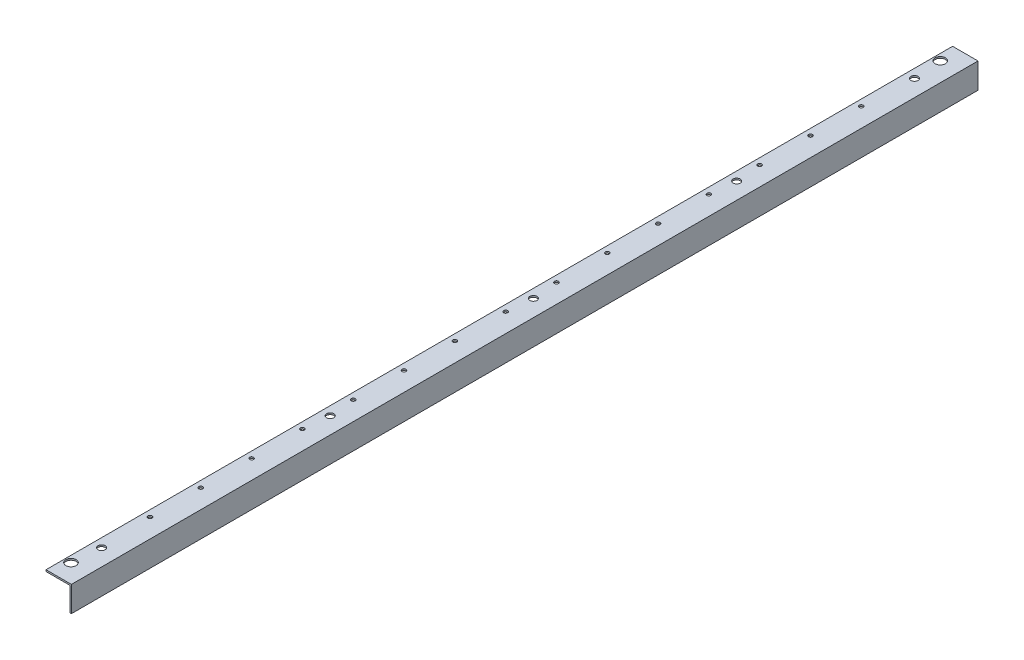
ISO-10303-21;
HEADER;
FILE_DESCRIPTION(('STEP AP214'),'2;1');
FILE_NAME('part.step','',(''),(''),'','','');
FILE_SCHEMA(('AUTOMOTIVE_DESIGN { 1 0 10303 214 1 1 1 1 }'));
ENDSEC;
DATA;
#1=APPLICATION_CONTEXT('core data for automotive mechanical design processes');
#2=APPLICATION_PROTOCOL_DEFINITION('international standard','automotive_design',2000,#1);
#3=PRODUCT_CONTEXT('',#1,'mechanical');
#4=PRODUCT('Part','Part','',(#3));
#5=PRODUCT_RELATED_PRODUCT_CATEGORY('part','',(#4));
#6=PRODUCT_DEFINITION_FORMATION('','',#4);
#7=PRODUCT_DEFINITION_CONTEXT('part definition',#1,'design');
#8=PRODUCT_DEFINITION('design','',#6,#7);
#9=PRODUCT_DEFINITION_SHAPE('','',#8);
#10=(LENGTH_UNIT() NAMED_UNIT(*) SI_UNIT(.MILLI.,.METRE.));
#11=(NAMED_UNIT(*) PLANE_ANGLE_UNIT() SI_UNIT($,.RADIAN.));
#12=(NAMED_UNIT(*) SI_UNIT($,.STERADIAN.) SOLID_ANGLE_UNIT());
#13=UNCERTAINTY_MEASURE_WITH_UNIT(LENGTH_MEASURE(1.E-05),#10,'distance_accuracy_value','');
#14=(GEOMETRIC_REPRESENTATION_CONTEXT(3) GLOBAL_UNCERTAINTY_ASSIGNED_CONTEXT((#13)) GLOBAL_UNIT_ASSIGNED_CONTEXT((#10,
#11,#12)) REPRESENTATION_CONTEXT('',''));
#15=CARTESIAN_POINT('',(0.,0.,0.));
#16=DIRECTION('',(0.,0.,1.));
#17=DIRECTION('',(1.,0.,0.));
#18=AXIS2_PLACEMENT_3D('',#15,#16,#17);
#19=CARTESIAN_POINT('',(-38.1,-44.45,1617.6625));
#20=DIRECTION('',(0.,1.,0.));
#21=DIRECTION('',(0.,0.,1.));
#22=AXIS2_PLACEMENT_3D('',#19,#20,#21);
#23=CYLINDRICAL_SURFACE('',#22,3.96874999999999);
#24=CARTESIAN_POINT('',(-38.1,0.,1617.6625));
#25=DIRECTION('',(0.,1.,0.));
#26=DIRECTION('',(0.,0.,1.));
#27=AXIS2_PLACEMENT_3D('',#24,#25,#26);
#28=CIRCLE('',#27,3.96874999999999);
#29=CARTESIAN_POINT('',(-38.1,0.,1621.63125));
#30=VERTEX_POINT('',#29);
#31=EDGE_CURVE('E47',#30,#30,#28,.T.);
#32=ORIENTED_EDGE('',*,*,#31,.T.);
#33=EDGE_LOOP('',(#32));
#34=FACE_BOUND('',#33,.T.);
#35=CARTESIAN_POINT('',(-38.1,-3.175,1617.6625));
#36=DIRECTION('',(0.,1.,0.));
#37=DIRECTION('',(0.,0.,1.));
#38=AXIS2_PLACEMENT_3D('',#35,#36,#37);
#39=CIRCLE('',#38,3.96874999999999);
#40=CARTESIAN_POINT('',(-38.1,-3.175,1621.63125));
#41=VERTEX_POINT('',#40);
#42=EDGE_CURVE('E11',#41,#41,#39,.T.);
#43=ORIENTED_EDGE('',*,*,#42,.F.);
#44=EDGE_LOOP('',(#43));
#45=FACE_BOUND('',#44,.T.);
#46=ADVANCED_FACE('F39',(#34,#45),#23,.F.);
#47=CARTESIAN_POINT('',(-38.1,-44.45,1516.0625));
#48=DIRECTION('',(0.,1.,0.));
#49=DIRECTION('',(0.,0.,1.));
#50=AXIS2_PLACEMENT_3D('',#47,#48,#49);
#51=CYLINDRICAL_SURFACE('',#50,3.96874999999999);
#52=CARTESIAN_POINT('',(-38.1,0.,1516.0625));
#53=DIRECTION('',(0.,1.,0.));
#54=DIRECTION('',(0.,0.,1.));
#55=AXIS2_PLACEMENT_3D('',#52,#53,#54);
#56=CIRCLE('',#55,3.96874999999999);
#57=CARTESIAN_POINT('',(-38.1,0.,1520.03125));
#58=VERTEX_POINT('',#57);
#59=EDGE_CURVE('E237',#58,#58,#56,.T.);
#60=ORIENTED_EDGE('',*,*,#59,.T.);
#61=EDGE_LOOP('',(#60));
#62=FACE_BOUND('',#61,.T.);
#63=CARTESIAN_POINT('',(-38.1,-3.175,1516.0625));
#64=DIRECTION('',(0.,1.,0.));
#65=DIRECTION('',(0.,0.,1.));
#66=AXIS2_PLACEMENT_3D('',#63,#64,#65);
#67=CIRCLE('',#66,3.96874999999999);
#68=CARTESIAN_POINT('',(-38.1,-3.175,1520.03125));
#69=VERTEX_POINT('',#68);
#70=EDGE_CURVE('E240',#69,#69,#67,.T.);
#71=ORIENTED_EDGE('',*,*,#70,.F.);
#72=EDGE_LOOP('',(#71));
#73=FACE_BOUND('',#72,.T.);
#74=ADVANCED_FACE('F267',(#62,#73),#51,.F.);
#75=CARTESIAN_POINT('',(-38.1,-44.45,1414.4625));
#76=DIRECTION('',(0.,1.,0.));
#77=DIRECTION('',(0.,0.,1.));
#78=AXIS2_PLACEMENT_3D('',#75,#76,#77);
#79=CYLINDRICAL_SURFACE('',#78,3.96874999999999);
#80=CARTESIAN_POINT('',(-38.1,0.,1414.4625));
#81=DIRECTION('',(0.,1.,0.));
#82=DIRECTION('',(0.,0.,1.));
#83=AXIS2_PLACEMENT_3D('',#80,#81,#82);
#84=CIRCLE('',#83,3.96874999999999);
#85=CARTESIAN_POINT('',(-38.1,0.,1418.43125));
#86=VERTEX_POINT('',#85);
#87=EDGE_CURVE('E231',#86,#86,#84,.T.);
#88=ORIENTED_EDGE('',*,*,#87,.T.);
#89=EDGE_LOOP('',(#88));
#90=FACE_BOUND('',#89,.T.);
#91=CARTESIAN_POINT('',(-38.1,-3.175,1414.4625));
#92=DIRECTION('',(0.,1.,0.));
#93=DIRECTION('',(0.,0.,1.));
#94=AXIS2_PLACEMENT_3D('',#91,#92,#93);
#95=CIRCLE('',#94,3.96874999999999);
#96=CARTESIAN_POINT('',(-38.1,-3.175,1418.43125));
#97=VERTEX_POINT('',#96);
#98=EDGE_CURVE('E234',#97,#97,#95,.T.);
#99=ORIENTED_EDGE('',*,*,#98,.F.);
#100=EDGE_LOOP('',(#99));
#101=FACE_BOUND('',#100,.T.);
#102=ADVANCED_FACE('F272',(#90,#101),#79,.F.);
#103=CARTESIAN_POINT('',(-38.1,-44.45,1312.8625));
#104=DIRECTION('',(0.,1.,0.));
#105=DIRECTION('',(0.,0.,1.));
#106=AXIS2_PLACEMENT_3D('',#103,#104,#105);
#107=CYLINDRICAL_SURFACE('',#106,3.96874999999999);
#108=CARTESIAN_POINT('',(-38.1,0.,1312.8625));
#109=DIRECTION('',(0.,1.,0.));
#110=DIRECTION('',(0.,0.,1.));
#111=AXIS2_PLACEMENT_3D('',#108,#109,#110);
#112=CIRCLE('',#111,3.96874999999999);
#113=CARTESIAN_POINT('',(-38.1,0.,1316.83125));
#114=VERTEX_POINT('',#113);
#115=EDGE_CURVE('E225',#114,#114,#112,.T.);
#116=ORIENTED_EDGE('',*,*,#115,.T.);
#117=EDGE_LOOP('',(#116));
#118=FACE_BOUND('',#117,.T.);
#119=CARTESIAN_POINT('',(-38.1,-3.175,1312.8625));
#120=DIRECTION('',(0.,1.,0.));
#121=DIRECTION('',(0.,0.,1.));
#122=AXIS2_PLACEMENT_3D('',#119,#120,#121);
#123=CIRCLE('',#122,3.96874999999999);
#124=CARTESIAN_POINT('',(-38.1,-3.175,1316.83125));
#125=VERTEX_POINT('',#124);
#126=EDGE_CURVE('E228',#125,#125,#123,.T.);
#127=ORIENTED_EDGE('',*,*,#126,.F.);
#128=EDGE_LOOP('',(#127));
#129=FACE_BOUND('',#128,.T.);
#130=ADVANCED_FACE('F277',(#118,#129),#107,.F.);
#131=CARTESIAN_POINT('',(-38.1,-44.45,1211.2625));
#132=DIRECTION('',(0.,1.,0.));
#133=DIRECTION('',(0.,0.,1.));
#134=AXIS2_PLACEMENT_3D('',#131,#132,#133);
#135=CYLINDRICAL_SURFACE('',#134,3.96874999999999);
#136=CARTESIAN_POINT('',(-38.1,0.,1211.2625));
#137=DIRECTION('',(0.,1.,0.));
#138=DIRECTION('',(0.,0.,1.));
#139=AXIS2_PLACEMENT_3D('',#136,#137,#138);
#140=CIRCLE('',#139,3.96874999999999);
#141=CARTESIAN_POINT('',(-38.1,0.,1215.23125));
#142=VERTEX_POINT('',#141);
#143=EDGE_CURVE('E219',#142,#142,#140,.T.);
#144=ORIENTED_EDGE('',*,*,#143,.T.);
#145=EDGE_LOOP('',(#144));
#146=FACE_BOUND('',#145,.T.);
#147=CARTESIAN_POINT('',(-38.1,-3.175,1211.2625));
#148=DIRECTION('',(0.,1.,0.));
#149=DIRECTION('',(0.,0.,1.));
#150=AXIS2_PLACEMENT_3D('',#147,#148,#149);
#151=CIRCLE('',#150,3.96874999999999);
#152=CARTESIAN_POINT('',(-38.1,-3.175,1215.23125));
#153=VERTEX_POINT('',#152);
#154=EDGE_CURVE('E222',#153,#153,#151,.T.);
#155=ORIENTED_EDGE('',*,*,#154,.F.);
#156=EDGE_LOOP('',(#155));
#157=FACE_BOUND('',#156,.T.);
#158=ADVANCED_FACE('F284',(#146,#157),#135,.F.);
#159=CARTESIAN_POINT('',(-38.1,-44.45,1109.6625));
#160=DIRECTION('',(0.,1.,0.));
#161=DIRECTION('',(0.,0.,1.));
#162=AXIS2_PLACEMENT_3D('',#159,#160,#161);
#163=CYLINDRICAL_SURFACE('',#162,3.96874999999999);
#164=CARTESIAN_POINT('',(-38.1,0.,1109.6625));
#165=DIRECTION('',(0.,1.,0.));
#166=DIRECTION('',(0.,0.,1.));
#167=AXIS2_PLACEMENT_3D('',#164,#165,#166);
#168=CIRCLE('',#167,3.96874999999999);
#169=CARTESIAN_POINT('',(-38.1,0.,1113.63125));
#170=VERTEX_POINT('',#169);
#171=EDGE_CURVE('E213',#170,#170,#168,.T.);
#172=ORIENTED_EDGE('',*,*,#171,.T.);
#173=EDGE_LOOP('',(#172));
#174=FACE_BOUND('',#173,.T.);
#175=CARTESIAN_POINT('',(-38.1,-3.175,1109.6625));
#176=DIRECTION('',(0.,1.,0.));
#177=DIRECTION('',(0.,0.,1.));
#178=AXIS2_PLACEMENT_3D('',#175,#176,#177);
#179=CIRCLE('',#178,3.96874999999999);
#180=CARTESIAN_POINT('',(-38.1,-3.175,1113.63125));
#181=VERTEX_POINT('',#180);
#182=EDGE_CURVE('E216',#181,#181,#179,.T.);
#183=ORIENTED_EDGE('',*,*,#182,.F.);
#184=EDGE_LOOP('',(#183));
#185=FACE_BOUND('',#184,.T.);
#186=ADVANCED_FACE('F288',(#174,#185),#163,.F.);
#187=CARTESIAN_POINT('',(-38.1,-44.45,1008.0625));
#188=DIRECTION('',(0.,1.,0.));
#189=DIRECTION('',(0.,0.,1.));
#190=AXIS2_PLACEMENT_3D('',#187,#188,#189);
#191=CYLINDRICAL_SURFACE('',#190,3.96874999999999);
#192=CARTESIAN_POINT('',(-38.1,0.,1008.0625));
#193=DIRECTION('',(0.,1.,0.));
#194=DIRECTION('',(0.,0.,1.));
#195=AXIS2_PLACEMENT_3D('',#192,#193,#194);
#196=CIRCLE('',#195,3.96874999999999);
#197=CARTESIAN_POINT('',(-38.1,0.,1012.03125));
#198=VERTEX_POINT('',#197);
#199=EDGE_CURVE('E207',#198,#198,#196,.T.);
#200=ORIENTED_EDGE('',*,*,#199,.T.);
#201=EDGE_LOOP('',(#200));
#202=FACE_BOUND('',#201,.T.);
#203=CARTESIAN_POINT('',(-38.1,-3.175,1008.0625));
#204=DIRECTION('',(0.,1.,0.));
#205=DIRECTION('',(0.,0.,1.));
#206=AXIS2_PLACEMENT_3D('',#203,#204,#205);
#207=CIRCLE('',#206,3.96874999999999);
#208=CARTESIAN_POINT('',(-38.1,-3.175,1012.03125));
#209=VERTEX_POINT('',#208);
#210=EDGE_CURVE('E210',#209,#209,#207,.T.);
#211=ORIENTED_EDGE('',*,*,#210,.F.);
#212=EDGE_LOOP('',(#211));
#213=FACE_BOUND('',#212,.T.);
#214=ADVANCED_FACE('F292',(#202,#213),#191,.F.);
#215=CARTESIAN_POINT('',(-38.1,-44.45,906.4625));
#216=DIRECTION('',(0.,1.,0.));
#217=DIRECTION('',(0.,0.,1.));
#218=AXIS2_PLACEMENT_3D('',#215,#216,#217);
#219=CYLINDRICAL_SURFACE('',#218,3.96874999999999);
#220=CARTESIAN_POINT('',(-38.1,0.,906.4625));
#221=DIRECTION('',(0.,1.,0.));
#222=DIRECTION('',(0.,0.,1.));
#223=AXIS2_PLACEMENT_3D('',#220,#221,#222);
#224=CIRCLE('',#223,3.96874999999999);
#225=CARTESIAN_POINT('',(-38.1,0.,910.43125));
#226=VERTEX_POINT('',#225);
#227=EDGE_CURVE('E201',#226,#226,#224,.T.);
#228=ORIENTED_EDGE('',*,*,#227,.T.);
#229=EDGE_LOOP('',(#228));
#230=FACE_BOUND('',#229,.T.);
#231=CARTESIAN_POINT('',(-38.1,-3.175,906.4625));
#232=DIRECTION('',(0.,1.,0.));
#233=DIRECTION('',(0.,0.,1.));
#234=AXIS2_PLACEMENT_3D('',#231,#232,#233);
#235=CIRCLE('',#234,3.96874999999999);
#236=CARTESIAN_POINT('',(-38.1,-3.175,910.43125));
#237=VERTEX_POINT('',#236);
#238=EDGE_CURVE('E204',#237,#237,#235,.T.);
#239=ORIENTED_EDGE('',*,*,#238,.F.);
#240=EDGE_LOOP('',(#239));
#241=FACE_BOUND('',#240,.T.);
#242=ADVANCED_FACE('F296',(#230,#241),#219,.F.);
#243=CARTESIAN_POINT('',(-38.1,-44.45,804.8625));
#244=DIRECTION('',(0.,1.,0.));
#245=DIRECTION('',(0.,0.,1.));
#246=AXIS2_PLACEMENT_3D('',#243,#244,#245);
#247=CYLINDRICAL_SURFACE('',#246,3.96874999999999);
#248=CARTESIAN_POINT('',(-38.1,0.,804.8625));
#249=DIRECTION('',(0.,1.,0.));
#250=DIRECTION('',(0.,0.,1.));
#251=AXIS2_PLACEMENT_3D('',#248,#249,#250);
#252=CIRCLE('',#251,3.96874999999999);
#253=CARTESIAN_POINT('',(-38.1,0.,808.83125));
#254=VERTEX_POINT('',#253);
#255=EDGE_CURVE('E195',#254,#254,#252,.T.);
#256=ORIENTED_EDGE('',*,*,#255,.T.);
#257=EDGE_LOOP('',(#256));
#258=FACE_BOUND('',#257,.T.);
#259=CARTESIAN_POINT('',(-38.1,-3.175,804.8625));
#260=DIRECTION('',(0.,1.,0.));
#261=DIRECTION('',(0.,0.,1.));
#262=AXIS2_PLACEMENT_3D('',#259,#260,#261);
#263=CIRCLE('',#262,3.96874999999999);
#264=CARTESIAN_POINT('',(-38.1,-3.175,808.83125));
#265=VERTEX_POINT('',#264);
#266=EDGE_CURVE('E198',#265,#265,#263,.T.);
#267=ORIENTED_EDGE('',*,*,#266,.F.);
#268=EDGE_LOOP('',(#267));
#269=FACE_BOUND('',#268,.T.);
#270=ADVANCED_FACE('F300',(#258,#269),#247,.F.);
#271=CARTESIAN_POINT('',(-38.1,-44.45,703.2625));
#272=DIRECTION('',(0.,1.,0.));
#273=DIRECTION('',(0.,0.,1.));
#274=AXIS2_PLACEMENT_3D('',#271,#272,#273);
#275=CYLINDRICAL_SURFACE('',#274,3.96874999999999);
#276=CARTESIAN_POINT('',(-38.1,0.,703.2625));
#277=DIRECTION('',(0.,1.,0.));
#278=DIRECTION('',(0.,0.,1.));
#279=AXIS2_PLACEMENT_3D('',#276,#277,#278);
#280=CIRCLE('',#279,3.96874999999999);
#281=CARTESIAN_POINT('',(-38.1,0.,707.23125));
#282=VERTEX_POINT('',#281);
#283=EDGE_CURVE('E189',#282,#282,#280,.T.);
#284=ORIENTED_EDGE('',*,*,#283,.T.);
#285=EDGE_LOOP('',(#284));
#286=FACE_BOUND('',#285,.T.);
#287=CARTESIAN_POINT('',(-38.1,-3.175,703.2625));
#288=DIRECTION('',(0.,1.,0.));
#289=DIRECTION('',(0.,0.,1.));
#290=AXIS2_PLACEMENT_3D('',#287,#288,#289);
#291=CIRCLE('',#290,3.96874999999999);
#292=CARTESIAN_POINT('',(-38.1,-3.175,707.23125));
#293=VERTEX_POINT('',#292);
#294=EDGE_CURVE('E192',#293,#293,#291,.T.);
#295=ORIENTED_EDGE('',*,*,#294,.F.);
#296=EDGE_LOOP('',(#295));
#297=FACE_BOUND('',#296,.T.);
#298=ADVANCED_FACE('F304',(#286,#297),#275,.F.);
#299=CARTESIAN_POINT('',(-38.1,-44.45,601.6625));
#300=DIRECTION('',(0.,1.,0.));
#301=DIRECTION('',(0.,0.,1.));
#302=AXIS2_PLACEMENT_3D('',#299,#300,#301);
#303=CYLINDRICAL_SURFACE('',#302,3.96874999999999);
#304=CARTESIAN_POINT('',(-38.1,0.,601.6625));
#305=DIRECTION('',(0.,1.,0.));
#306=DIRECTION('',(0.,0.,1.));
#307=AXIS2_PLACEMENT_3D('',#304,#305,#306);
#308=CIRCLE('',#307,3.96874999999999);
#309=CARTESIAN_POINT('',(-38.1,0.,605.63125));
#310=VERTEX_POINT('',#309);
#311=EDGE_CURVE('E183',#310,#310,#308,.T.);
#312=ORIENTED_EDGE('',*,*,#311,.T.);
#313=EDGE_LOOP('',(#312));
#314=FACE_BOUND('',#313,.T.);
#315=CARTESIAN_POINT('',(-38.1,-3.175,601.6625));
#316=DIRECTION('',(0.,1.,0.));
#317=DIRECTION('',(0.,0.,1.));
#318=AXIS2_PLACEMENT_3D('',#315,#316,#317);
#319=CIRCLE('',#318,3.96874999999999);
#320=CARTESIAN_POINT('',(-38.1,-3.175,605.63125));
#321=VERTEX_POINT('',#320);
#322=EDGE_CURVE('E186',#321,#321,#319,.T.);
#323=ORIENTED_EDGE('',*,*,#322,.F.);
#324=EDGE_LOOP('',(#323));
#325=FACE_BOUND('',#324,.T.);
#326=ADVANCED_FACE('F308',(#314,#325),#303,.F.);
#327=CARTESIAN_POINT('',(-38.1,-44.45,500.0625));
#328=DIRECTION('',(0.,1.,0.));
#329=DIRECTION('',(0.,0.,1.));
#330=AXIS2_PLACEMENT_3D('',#327,#328,#329);
#331=CYLINDRICAL_SURFACE('',#330,3.96874999999999);
#332=CARTESIAN_POINT('',(-38.1,0.,500.0625));
#333=DIRECTION('',(0.,1.,0.));
#334=DIRECTION('',(0.,0.,1.));
#335=AXIS2_PLACEMENT_3D('',#332,#333,#334);
#336=CIRCLE('',#335,3.96874999999999);
#337=CARTESIAN_POINT('',(-38.1,0.,504.03125));
#338=VERTEX_POINT('',#337);
#339=EDGE_CURVE('E177',#338,#338,#336,.T.);
#340=ORIENTED_EDGE('',*,*,#339,.T.);
#341=EDGE_LOOP('',(#340));
#342=FACE_BOUND('',#341,.T.);
#343=CARTESIAN_POINT('',(-38.1,-3.175,500.0625));
#344=DIRECTION('',(0.,1.,0.));
#345=DIRECTION('',(0.,0.,1.));
#346=AXIS2_PLACEMENT_3D('',#343,#344,#345);
#347=CIRCLE('',#346,3.96874999999999);
#348=CARTESIAN_POINT('',(-38.1,-3.175,504.03125));
#349=VERTEX_POINT('',#348);
#350=EDGE_CURVE('E180',#349,#349,#347,.T.);
#351=ORIENTED_EDGE('',*,*,#350,.F.);
#352=EDGE_LOOP('',(#351));
#353=FACE_BOUND('',#352,.T.);
#354=ADVANCED_FACE('F312',(#342,#353),#331,.F.);
#355=CARTESIAN_POINT('',(-38.1,-44.45,398.4625));
#356=DIRECTION('',(0.,1.,0.));
#357=DIRECTION('',(0.,0.,1.));
#358=AXIS2_PLACEMENT_3D('',#355,#356,#357);
#359=CYLINDRICAL_SURFACE('',#358,3.96874999999999);
#360=CARTESIAN_POINT('',(-38.1,0.,398.4625));
#361=DIRECTION('',(0.,1.,0.));
#362=DIRECTION('',(0.,0.,1.));
#363=AXIS2_PLACEMENT_3D('',#360,#361,#362);
#364=CIRCLE('',#363,3.96874999999999);
#365=CARTESIAN_POINT('',(-38.1,0.,402.43125));
#366=VERTEX_POINT('',#365);
#367=EDGE_CURVE('E145',#366,#366,#364,.T.);
#368=ORIENTED_EDGE('',*,*,#367,.T.);
#369=EDGE_LOOP('',(#368));
#370=FACE_BOUND('',#369,.T.);
#371=CARTESIAN_POINT('',(-38.1,-3.175,398.4625));
#372=DIRECTION('',(0.,1.,0.));
#373=DIRECTION('',(0.,0.,1.));
#374=AXIS2_PLACEMENT_3D('',#371,#372,#373);
#375=CIRCLE('',#374,3.96874999999999);
#376=CARTESIAN_POINT('',(-38.1,-3.175,402.43125));
#377=VERTEX_POINT('',#376);
#378=EDGE_CURVE('E174',#377,#377,#375,.T.);
#379=ORIENTED_EDGE('',*,*,#378,.F.);
#380=EDGE_LOOP('',(#379));
#381=FACE_BOUND('',#380,.T.);
#382=ADVANCED_FACE('F261',(#370,#381),#359,.F.);
#383=CARTESIAN_POINT('',(0.,-50.8,1812.925));
#384=DIRECTION('',(-1.,0.,0.));
#385=DIRECTION('',(0.,0.,1.));
#386=AXIS2_PLACEMENT_3D('',#383,#384,#385);
#387=PLANE('',#386);
#388=DIRECTION('',(0.,1.,0.));
#389=VECTOR('',#388,1.);
#390=CARTESIAN_POINT('',(0.,-50.8,0.));
#391=LINE('',#390,#389);
#392=CARTESIAN_POINT('',(0.,-50.8,0.));
#393=VERTEX_POINT('',#392);
#394=CARTESIAN_POINT('',(0.,0.,0.));
#395=VERTEX_POINT('',#394);
#396=EDGE_CURVE('E125',#393,#395,#391,.T.);
#397=ORIENTED_EDGE('',*,*,#396,.T.);
#398=DIRECTION('',(0.,0.,-1.));
#399=VECTOR('',#398,1.);
#400=CARTESIAN_POINT('',(0.,0.,1812.925));
#401=LINE('',#400,#399);
#402=CARTESIAN_POINT('',(0.,0.,1812.925));
#403=VERTEX_POINT('',#402);
#404=EDGE_CURVE('E143',#403,#395,#401,.T.);
#405=ORIENTED_EDGE('',*,*,#404,.F.);
#406=DIRECTION('',(0.,1.,0.));
#407=VECTOR('',#406,1.);
#408=CARTESIAN_POINT('',(0.,-50.8,1812.925));
#409=LINE('',#408,#407);
#410=CARTESIAN_POINT('',(0.,-50.8,1812.925));
#411=VERTEX_POINT('',#410);
#412=EDGE_CURVE('E136',#411,#403,#409,.T.);
#413=ORIENTED_EDGE('',*,*,#412,.F.);
#414=DIRECTION('',(0.,0.,-1.));
#415=VECTOR('',#414,1.);
#416=CARTESIAN_POINT('',(0.,-50.8,1812.925));
#417=LINE('',#416,#415);
#418=EDGE_CURVE('E121',#411,#393,#417,.T.);
#419=ORIENTED_EDGE('',*,*,#418,.T.);
#420=EDGE_LOOP('',(#397,#405,#413,#419));
#421=FACE_BOUND('',#420,.T.);
#422=ADVANCED_FACE('F250',(#421),#387,.F.);
#423=CARTESIAN_POINT('',(0.,0.,1812.925));
#424=DIRECTION('',(0.,-1.,0.));
#425=DIRECTION('',(0.,0.,-1.));
#426=AXIS2_PLACEMENT_3D('',#423,#424,#425);
#427=PLANE('',#426);
#428=CARTESIAN_POINT('',(-38.1,0.,296.8625));
#429=DIRECTION('',(0.,1.,0.));
#430=DIRECTION('',(0.,0.,1.));
#431=AXIS2_PLACEMENT_3D('',#428,#429,#430);
#432=CIRCLE('',#431,3.96874999999999);
#433=CARTESIAN_POINT('',(-38.1,0.,300.83125));
#434=VERTEX_POINT('',#433);
#435=EDGE_CURVE('E413',#434,#434,#432,.T.);
#436=ORIENTED_EDGE('',*,*,#435,.F.);
#437=EDGE_LOOP('',(#436));
#438=FACE_BOUND('',#437,.T.);
#439=CARTESIAN_POINT('',(-38.1,0.,195.2625));
#440=DIRECTION('',(0.,1.,0.));
#441=DIRECTION('',(0.,0.,1.));
#442=AXIS2_PLACEMENT_3D('',#439,#440,#441);
#443=CIRCLE('',#442,3.96874999999999);
#444=CARTESIAN_POINT('',(-38.1,0.,199.23125));
#445=VERTEX_POINT('',#444);
#446=EDGE_CURVE('E171',#445,#445,#443,.T.);
#447=ORIENTED_EDGE('',*,*,#446,.F.);
#448=EDGE_LOOP('',(#447));
#449=FACE_BOUND('',#448,.T.);
#450=CARTESIAN_POINT('',(-38.1,0.,37.3062500000001));
#451=DIRECTION('',(0.,1.,0.));
#452=DIRECTION('',(0.,0.,1.));
#453=AXIS2_PLACEMENT_3D('',#450,#451,#452);
#454=CIRCLE('',#453,10.31875);
#455=CARTESIAN_POINT('',(-38.1,0.,47.6250000000001));
#456=VERTEX_POINT('',#455);
#457=EDGE_CURVE('E150',#456,#456,#454,.T.);
#458=ORIENTED_EDGE('',*,*,#457,.F.);
#459=EDGE_LOOP('',(#458));
#460=FACE_BOUND('',#459,.T.);
#461=CARTESIAN_POINT('',(-33.3375,0.,1719.2625));
#462=DIRECTION('',(0.,1.,0.));
#463=DIRECTION('',(0.,0.,1.));
#464=AXIS2_PLACEMENT_3D('',#461,#462,#463);
#465=CIRCLE('',#464,7.14375000000008);
#466=CARTESIAN_POINT('',(-33.3375,0.,1726.40625));
#467=VERTEX_POINT('',#466);
#468=EDGE_CURVE('E170',#467,#467,#465,.T.);
#469=ORIENTED_EDGE('',*,*,#468,.F.);
#470=EDGE_LOOP('',(#469));
#471=FACE_BOUND('',#470,.T.);
#472=CARTESIAN_POINT('',(-33.3375,0.,1262.0625));
#473=DIRECTION('',(0.,1.,0.));
#474=DIRECTION('',(0.,0.,1.));
#475=AXIS2_PLACEMENT_3D('',#472,#473,#474);
#476=CIRCLE('',#475,7.14375);
#477=CARTESIAN_POINT('',(-33.3375,0.,1269.20625));
#478=VERTEX_POINT('',#477);
#479=EDGE_CURVE('E424',#478,#478,#476,.T.);
#480=ORIENTED_EDGE('',*,*,#479,.F.);
#481=EDGE_LOOP('',(#480));
#482=FACE_BOUND('',#481,.T.);
#483=CARTESIAN_POINT('',(-38.0999999999999,0.,1775.61875));
#484=DIRECTION('',(0.,1.,0.));
#485=DIRECTION('',(0.,0.,1.));
#486=AXIS2_PLACEMENT_3D('',#483,#484,#485);
#487=CIRCLE('',#486,10.31875);
#488=CARTESIAN_POINT('',(-38.0999999999999,0.,1785.9375));
#489=VERTEX_POINT('',#488);
#490=EDGE_CURVE('E423',#489,#489,#487,.T.);
#491=ORIENTED_EDGE('',*,*,#490,.F.);
#492=EDGE_LOOP('',(#491));
#493=FACE_BOUND('',#492,.T.);
#494=CARTESIAN_POINT('',(-33.3375,0.,93.6625));
#495=DIRECTION('',(0.,1.,0.));
#496=DIRECTION('',(0.,0.,1.));
#497=AXIS2_PLACEMENT_3D('',#494,#495,#496);
#498=CIRCLE('',#497,7.14375);
#499=CARTESIAN_POINT('',(-33.3375,0.,100.80625));
#500=VERTEX_POINT('',#499);
#501=EDGE_CURVE('E433',#500,#500,#498,.T.);
#502=ORIENTED_EDGE('',*,*,#501,.F.);
#503=EDGE_LOOP('',(#502));
#504=FACE_BOUND('',#503,.T.);
#505=CARTESIAN_POINT('',(-33.3375,0.,449.2625));
#506=DIRECTION('',(0.,1.,0.));
#507=DIRECTION('',(0.,0.,1.));
#508=AXIS2_PLACEMENT_3D('',#505,#506,#507);
#509=CIRCLE('',#508,7.14375000000002);
#510=CARTESIAN_POINT('',(-33.3375,0.,456.40625));
#511=VERTEX_POINT('',#510);
#512=EDGE_CURVE('E430',#511,#511,#509,.T.);
#513=ORIENTED_EDGE('',*,*,#512,.F.);
#514=EDGE_LOOP('',(#513));
#515=FACE_BOUND('',#514,.T.);
#516=CARTESIAN_POINT('',(-33.3375,0.,855.6625));
#517=DIRECTION('',(0.,1.,0.));
#518=DIRECTION('',(0.,0.,1.));
#519=AXIS2_PLACEMENT_3D('',#516,#517,#518);
#520=CIRCLE('',#519,7.14374999999997);
#521=CARTESIAN_POINT('',(-33.3375,0.,862.80625));
#522=VERTEX_POINT('',#521);
#523=EDGE_CURVE('E427',#522,#522,#520,.T.);
#524=ORIENTED_EDGE('',*,*,#523,.F.);
#525=EDGE_LOOP('',(#524));
#526=FACE_BOUND('',#525,.T.);
#527=DIRECTION('',(-1.,0.,0.));
#528=VECTOR('',#527,1.);
#529=CARTESIAN_POINT('',(0.,0.,0.));
#530=LINE('',#529,#528);
#531=CARTESIAN_POINT('',(-50.8,0.,0.));
#532=VERTEX_POINT('',#531);
#533=EDGE_CURVE('E128',#395,#532,#530,.T.);
#534=ORIENTED_EDGE('',*,*,#533,.T.);
#535=DIRECTION('',(0.,0.,-1.));
#536=VECTOR('',#535,1.);
#537=CARTESIAN_POINT('',(-50.8,0.,1812.925));
#538=LINE('',#537,#536);
#539=CARTESIAN_POINT('',(-50.8,0.,1812.925));
#540=VERTEX_POINT('',#539);
#541=EDGE_CURVE('E140',#540,#532,#538,.T.);
#542=ORIENTED_EDGE('',*,*,#541,.F.);
#543=DIRECTION('',(-1.,0.,0.));
#544=VECTOR('',#543,1.);
#545=CARTESIAN_POINT('',(0.,0.,1812.925));
#546=LINE('',#545,#544);
#547=EDGE_CURVE('E93',#403,#540,#546,.T.);
#548=ORIENTED_EDGE('',*,*,#547,.F.);
#549=ORIENTED_EDGE('',*,*,#404,.T.);
#550=EDGE_LOOP('',(#534,#542,#548,#549));
#551=FACE_BOUND('',#550,.T.);
#552=ORIENTED_EDGE('',*,*,#367,.F.);
#553=EDGE_LOOP('',(#552));
#554=FACE_BOUND('',#553,.T.);
#555=ORIENTED_EDGE('',*,*,#339,.F.);
#556=EDGE_LOOP('',(#555));
#557=FACE_BOUND('',#556,.T.);
#558=ORIENTED_EDGE('',*,*,#311,.F.);
#559=EDGE_LOOP('',(#558));
#560=FACE_BOUND('',#559,.T.);
#561=ORIENTED_EDGE('',*,*,#283,.F.);
#562=EDGE_LOOP('',(#561));
#563=FACE_BOUND('',#562,.T.);
#564=ORIENTED_EDGE('',*,*,#255,.F.);
#565=EDGE_LOOP('',(#564));
#566=FACE_BOUND('',#565,.T.);
#567=ORIENTED_EDGE('',*,*,#227,.F.);
#568=EDGE_LOOP('',(#567));
#569=FACE_BOUND('',#568,.T.);
#570=ORIENTED_EDGE('',*,*,#199,.F.);
#571=EDGE_LOOP('',(#570));
#572=FACE_BOUND('',#571,.T.);
#573=ORIENTED_EDGE('',*,*,#171,.F.);
#574=EDGE_LOOP('',(#573));
#575=FACE_BOUND('',#574,.T.);
#576=ORIENTED_EDGE('',*,*,#143,.F.);
#577=EDGE_LOOP('',(#576));
#578=FACE_BOUND('',#577,.T.);
#579=ORIENTED_EDGE('',*,*,#115,.F.);
#580=EDGE_LOOP('',(#579));
#581=FACE_BOUND('',#580,.T.);
#582=ORIENTED_EDGE('',*,*,#87,.F.);
#583=EDGE_LOOP('',(#582));
#584=FACE_BOUND('',#583,.T.);
#585=ORIENTED_EDGE('',*,*,#59,.F.);
#586=EDGE_LOOP('',(#585));
#587=FACE_BOUND('',#586,.T.);
#588=ORIENTED_EDGE('',*,*,#31,.F.);
#589=EDGE_LOOP('',(#588));
#590=FACE_BOUND('',#589,.T.);
#591=ADVANCED_FACE('F247',(#438,#449,#460,#471,#482,#493,#504,#515,#526,#551,#554,#557,#560,
#563,#566,#569,#572,#575,#578,#581,#584,#587,#590),#427,.F.);
#592=CARTESIAN_POINT('',(-50.8,0.,1812.925));
#593=DIRECTION('',(1.,0.,0.));
#594=DIRECTION('',(0.,0.,-1.));
#595=AXIS2_PLACEMENT_3D('',#592,#593,#594);
#596=PLANE('',#595);
#597=DIRECTION('',(0.,-1.,0.));
#598=VECTOR('',#597,1.);
#599=CARTESIAN_POINT('',(-50.8,0.,0.));
#600=LINE('',#599,#598);
#601=CARTESIAN_POINT('',(-50.8,-3.17500000000001,0.));
#602=VERTEX_POINT('',#601);
#603=EDGE_CURVE('E131',#532,#602,#600,.T.);
#604=ORIENTED_EDGE('',*,*,#603,.T.);
#605=DIRECTION('',(0.,0.,-1.));
#606=VECTOR('',#605,1.);
#607=CARTESIAN_POINT('',(-50.8,-3.17500000000001,1812.925));
#608=LINE('',#607,#606);
#609=CARTESIAN_POINT('',(-50.8,-3.17500000000001,1812.925));
#610=VERTEX_POINT('',#609);
#611=EDGE_CURVE('E116',#610,#602,#608,.T.);
#612=ORIENTED_EDGE('',*,*,#611,.F.);
#613=DIRECTION('',(0.,-1.,0.));
#614=VECTOR('',#613,1.);
#615=CARTESIAN_POINT('',(-50.8,0.,1812.925));
#616=LINE('',#615,#614);
#617=EDGE_CURVE('E106',#540,#610,#616,.T.);
#618=ORIENTED_EDGE('',*,*,#617,.F.);
#619=ORIENTED_EDGE('',*,*,#541,.T.);
#620=EDGE_LOOP('',(#604,#612,#618,#619));
#621=FACE_BOUND('',#620,.T.);
#622=ADVANCED_FACE('F249',(#621),#596,.F.);
#623=CARTESIAN_POINT('',(-50.8,-3.17500000000001,1812.925));
#624=DIRECTION('',(0.,1.,0.));
#625=DIRECTION('',(0.,0.,1.));
#626=AXIS2_PLACEMENT_3D('',#623,#624,#625);
#627=PLANE('',#626);
#628=CARTESIAN_POINT('',(-38.1,-3.175,296.8625));
#629=DIRECTION('',(0.,1.,0.));
#630=DIRECTION('',(0.,0.,1.));
#631=AXIS2_PLACEMENT_3D('',#628,#629,#630);
#632=CIRCLE('',#631,3.96874999999999);
#633=CARTESIAN_POINT('',(-38.1,-3.175,300.83125));
#634=VERTEX_POINT('',#633);
#635=EDGE_CURVE('E415',#634,#634,#632,.T.);
#636=ORIENTED_EDGE('',*,*,#635,.T.);
#637=EDGE_LOOP('',(#636));
#638=FACE_BOUND('',#637,.T.);
#639=CARTESIAN_POINT('',(-38.1,-3.175,195.2625));
#640=DIRECTION('',(0.,1.,0.));
#641=DIRECTION('',(0.,0.,1.));
#642=AXIS2_PLACEMENT_3D('',#639,#640,#641);
#643=CIRCLE('',#642,3.96874999999999);
#644=CARTESIAN_POINT('',(-38.1,-3.175,199.23125));
#645=VERTEX_POINT('',#644);
#646=EDGE_CURVE('E167',#645,#645,#643,.T.);
#647=ORIENTED_EDGE('',*,*,#646,.T.);
#648=EDGE_LOOP('',(#647));
#649=FACE_BOUND('',#648,.T.);
#650=CARTESIAN_POINT('',(-38.1,-3.175,37.3062500000001));
#651=DIRECTION('',(0.,1.,0.));
#652=DIRECTION('',(0.,0.,1.));
#653=AXIS2_PLACEMENT_3D('',#650,#651,#652);
#654=CIRCLE('',#653,10.31875);
#655=CARTESIAN_POINT('',(-38.1,-3.175,47.6250000000001));
#656=VERTEX_POINT('',#655);
#657=EDGE_CURVE('E129',#656,#656,#654,.T.);
#658=ORIENTED_EDGE('',*,*,#657,.T.);
#659=EDGE_LOOP('',(#658));
#660=FACE_BOUND('',#659,.T.);
#661=CARTESIAN_POINT('',(-33.3375,-3.175,1719.2625));
#662=DIRECTION('',(0.,1.,0.));
#663=DIRECTION('',(0.,0.,1.));
#664=AXIS2_PLACEMENT_3D('',#661,#662,#663);
#665=CIRCLE('',#664,7.14375000000008);
#666=CARTESIAN_POINT('',(-33.3375,-3.175,1726.40625));
#667=VERTEX_POINT('',#666);
#668=EDGE_CURVE('E162',#667,#667,#665,.T.);
#669=ORIENTED_EDGE('',*,*,#668,.T.);
#670=EDGE_LOOP('',(#669));
#671=FACE_BOUND('',#670,.T.);
#672=CARTESIAN_POINT('',(-33.3375,-3.175,1262.0625));
#673=DIRECTION('',(0.,1.,0.));
#674=DIRECTION('',(0.,0.,1.));
#675=AXIS2_PLACEMENT_3D('',#672,#673,#674);
#676=CIRCLE('',#675,7.14375);
#677=CARTESIAN_POINT('',(-33.3375,-3.175,1269.20625));
#678=VERTEX_POINT('',#677);
#679=EDGE_CURVE('E159',#678,#678,#676,.T.);
#680=ORIENTED_EDGE('',*,*,#679,.T.);
#681=EDGE_LOOP('',(#680));
#682=FACE_BOUND('',#681,.T.);
#683=CARTESIAN_POINT('',(-38.0999999999999,-3.175,1775.61875));
#684=DIRECTION('',(0.,1.,0.));
#685=DIRECTION('',(0.,0.,1.));
#686=AXIS2_PLACEMENT_3D('',#683,#684,#685);
#687=CIRCLE('',#686,10.31875);
#688=CARTESIAN_POINT('',(-38.0999999999999,-3.175,1785.9375));
#689=VERTEX_POINT('',#688);
#690=EDGE_CURVE('E156',#689,#689,#687,.T.);
#691=ORIENTED_EDGE('',*,*,#690,.T.);
#692=EDGE_LOOP('',(#691));
#693=FACE_BOUND('',#692,.T.);
#694=CARTESIAN_POINT('',(-33.3375,-3.175,93.6625));
#695=DIRECTION('',(0.,1.,0.));
#696=DIRECTION('',(0.,0.,1.));
#697=AXIS2_PLACEMENT_3D('',#694,#695,#696);
#698=CIRCLE('',#697,7.14375);
#699=CARTESIAN_POINT('',(-33.3375,-3.175,100.80625));
#700=VERTEX_POINT('',#699);
#701=EDGE_CURVE('E153',#700,#700,#698,.T.);
#702=ORIENTED_EDGE('',*,*,#701,.T.);
#703=EDGE_LOOP('',(#702));
#704=FACE_BOUND('',#703,.T.);
#705=CARTESIAN_POINT('',(-33.3375,-3.175,449.2625));
#706=DIRECTION('',(0.,1.,0.));
#707=DIRECTION('',(0.,0.,1.));
#708=AXIS2_PLACEMENT_3D('',#705,#706,#707);
#709=CIRCLE('',#708,7.14375000000002);
#710=CARTESIAN_POINT('',(-33.3375,-3.175,456.40625));
#711=VERTEX_POINT('',#710);
#712=EDGE_CURVE('E149',#711,#711,#709,.T.);
#713=ORIENTED_EDGE('',*,*,#712,.T.);
#714=EDGE_LOOP('',(#713));
#715=FACE_BOUND('',#714,.T.);
#716=CARTESIAN_POINT('',(-33.3375,-3.175,855.6625));
#717=DIRECTION('',(0.,1.,0.));
#718=DIRECTION('',(0.,0.,1.));
#719=AXIS2_PLACEMENT_3D('',#716,#717,#718);
#720=CIRCLE('',#719,7.14374999999997);
#721=CARTESIAN_POINT('',(-33.3375,-3.175,862.80625));
#722=VERTEX_POINT('',#721);
#723=EDGE_CURVE('E146',#722,#722,#720,.T.);
#724=ORIENTED_EDGE('',*,*,#723,.T.);
#725=EDGE_LOOP('',(#724));
#726=FACE_BOUND('',#725,.T.);
#727=DIRECTION('',(1.,0.,0.));
#728=VECTOR('',#727,1.);
#729=CARTESIAN_POINT('',(-50.8,-3.17500000000001,0.));
#730=LINE('',#729,#728);
#731=CARTESIAN_POINT('',(-3.17500000000001,-3.17500000000001,0.));
#732=VERTEX_POINT('',#731);
#733=EDGE_CURVE('E115',#602,#732,#730,.T.);
#734=ORIENTED_EDGE('',*,*,#733,.T.);
#735=DIRECTION('',(0.,0.,-1.));
#736=VECTOR('',#735,1.);
#737=CARTESIAN_POINT('',(-3.17500000000001,-3.17500000000001,1812.925));
#738=LINE('',#737,#736);
#739=CARTESIAN_POINT('',(-3.17500000000001,-3.17500000000001,1812.925));
#740=VERTEX_POINT('',#739);
#741=EDGE_CURVE('E111',#740,#732,#738,.T.);
#742=ORIENTED_EDGE('',*,*,#741,.F.);
#743=DIRECTION('',(1.,0.,0.));
#744=VECTOR('',#743,1.);
#745=CARTESIAN_POINT('',(-50.8,-3.17500000000001,1812.925));
#746=LINE('',#745,#744);
#747=EDGE_CURVE('E100',#610,#740,#746,.T.);
#748=ORIENTED_EDGE('',*,*,#747,.F.);
#749=ORIENTED_EDGE('',*,*,#611,.T.);
#750=EDGE_LOOP('',(#734,#742,#748,#749));
#751=FACE_BOUND('',#750,.T.);
#752=ORIENTED_EDGE('',*,*,#378,.T.);
#753=EDGE_LOOP('',(#752));
#754=FACE_BOUND('',#753,.T.);
#755=ORIENTED_EDGE('',*,*,#350,.T.);
#756=EDGE_LOOP('',(#755));
#757=FACE_BOUND('',#756,.T.);
#758=ORIENTED_EDGE('',*,*,#322,.T.);
#759=EDGE_LOOP('',(#758));
#760=FACE_BOUND('',#759,.T.);
#761=ORIENTED_EDGE('',*,*,#294,.T.);
#762=EDGE_LOOP('',(#761));
#763=FACE_BOUND('',#762,.T.);
#764=ORIENTED_EDGE('',*,*,#266,.T.);
#765=EDGE_LOOP('',(#764));
#766=FACE_BOUND('',#765,.T.);
#767=ORIENTED_EDGE('',*,*,#238,.T.);
#768=EDGE_LOOP('',(#767));
#769=FACE_BOUND('',#768,.T.);
#770=ORIENTED_EDGE('',*,*,#210,.T.);
#771=EDGE_LOOP('',(#770));
#772=FACE_BOUND('',#771,.T.);
#773=ORIENTED_EDGE('',*,*,#182,.T.);
#774=EDGE_LOOP('',(#773));
#775=FACE_BOUND('',#774,.T.);
#776=ORIENTED_EDGE('',*,*,#154,.T.);
#777=EDGE_LOOP('',(#776));
#778=FACE_BOUND('',#777,.T.);
#779=ORIENTED_EDGE('',*,*,#126,.T.);
#780=EDGE_LOOP('',(#779));
#781=FACE_BOUND('',#780,.T.);
#782=ORIENTED_EDGE('',*,*,#98,.T.);
#783=EDGE_LOOP('',(#782));
#784=FACE_BOUND('',#783,.T.);
#785=ORIENTED_EDGE('',*,*,#70,.T.);
#786=EDGE_LOOP('',(#785));
#787=FACE_BOUND('',#786,.T.);
#788=ORIENTED_EDGE('',*,*,#42,.T.);
#789=EDGE_LOOP('',(#788));
#790=FACE_BOUND('',#789,.T.);
#791=ADVANCED_FACE('F112',(#638,#649,#660,#671,#682,#693,#704,#715,#726,#751,#754,#757,#760,
#763,#766,#769,#772,#775,#778,#781,#784,#787,#790),#627,.F.);
#792=CARTESIAN_POINT('',(-3.17500000000001,-3.17500000000001,1812.925));
#793=DIRECTION('',(1.,0.,0.));
#794=DIRECTION('',(0.,1.,0.));
#795=AXIS2_PLACEMENT_3D('',#792,#793,#794);
#796=PLANE('',#795);
#797=DIRECTION('',(0.,-1.,0.));
#798=VECTOR('',#797,1.);
#799=CARTESIAN_POINT('',(-3.17500000000001,-3.17500000000001,0.));
#800=LINE('',#799,#798);
#801=CARTESIAN_POINT('',(-3.175,-50.8,0.));
#802=VERTEX_POINT('',#801);
#803=EDGE_CURVE('E78',#732,#802,#800,.T.);
#804=ORIENTED_EDGE('',*,*,#803,.T.);
#805=DIRECTION('',(0.,0.,-1.));
#806=VECTOR('',#805,1.);
#807=CARTESIAN_POINT('',(-3.175,-50.8,1812.925));
#808=LINE('',#807,#806);
#809=CARTESIAN_POINT('',(-3.175,-50.8,1812.925));
#810=VERTEX_POINT('',#809);
#811=EDGE_CURVE('E117',#810,#802,#808,.T.);
#812=ORIENTED_EDGE('',*,*,#811,.F.);
#813=DIRECTION('',(0.,-1.,0.));
#814=VECTOR('',#813,1.);
#815=CARTESIAN_POINT('',(-3.17500000000001,-3.17500000000001,1812.925));
#816=LINE('',#815,#814);
#817=EDGE_CURVE('E104',#740,#810,#816,.T.);
#818=ORIENTED_EDGE('',*,*,#817,.F.);
#819=ORIENTED_EDGE('',*,*,#741,.T.);
#820=EDGE_LOOP('',(#804,#812,#818,#819));
#821=FACE_BOUND('',#820,.T.);
#822=ADVANCED_FACE('F119',(#821),#796,.F.);
#823=CARTESIAN_POINT('',(-3.175,-50.8,1812.925));
#824=DIRECTION('',(0.,1.,0.));
#825=DIRECTION('',(0.,0.,1.));
#826=AXIS2_PLACEMENT_3D('',#823,#824,#825);
#827=PLANE('',#826);
#828=DIRECTION('',(1.,0.,0.));
#829=VECTOR('',#828,1.);
#830=CARTESIAN_POINT('',(-3.175,-50.8,0.));
#831=LINE('',#830,#829);
#832=EDGE_CURVE('E84',#802,#393,#831,.T.);
#833=ORIENTED_EDGE('',*,*,#832,.T.);
#834=ORIENTED_EDGE('',*,*,#418,.F.);
#835=DIRECTION('',(1.,0.,0.));
#836=VECTOR('',#835,1.);
#837=CARTESIAN_POINT('',(-3.175,-50.8,1812.925));
#838=LINE('',#837,#836);
#839=EDGE_CURVE('E55',#810,#411,#838,.T.);
#840=ORIENTED_EDGE('',*,*,#839,.F.);
#841=ORIENTED_EDGE('',*,*,#811,.T.);
#842=EDGE_LOOP('',(#833,#834,#840,#841));
#843=FACE_BOUND('',#842,.T.);
#844=ADVANCED_FACE('F363',(#843),#827,.F.);
#845=CARTESIAN_POINT('',(0.,0.,1812.925));
#846=DIRECTION('',(0.,0.,1.));
#847=DIRECTION('',(1.,0.,0.));
#848=AXIS2_PLACEMENT_3D('',#845,#846,#847);
#849=PLANE('',#848);
#850=ORIENTED_EDGE('',*,*,#412,.T.);
#851=ORIENTED_EDGE('',*,*,#547,.T.);
#852=ORIENTED_EDGE('',*,*,#617,.T.);
#853=ORIENTED_EDGE('',*,*,#747,.T.);
#854=ORIENTED_EDGE('',*,*,#817,.T.);
#855=ORIENTED_EDGE('',*,*,#839,.T.);
#856=EDGE_LOOP('',(#850,#851,#852,#853,#854,#855));
#857=FACE_BOUND('',#856,.T.);
#858=ADVANCED_FACE('F102',(#857),#849,.T.);
#859=CARTESIAN_POINT('',(0.,0.,0.));
#860=DIRECTION('',(0.,0.,1.));
#861=DIRECTION('',(1.,0.,0.));
#862=AXIS2_PLACEMENT_3D('',#859,#860,#861);
#863=PLANE('',#862);
#864=ORIENTED_EDGE('',*,*,#396,.F.);
#865=ORIENTED_EDGE('',*,*,#832,.F.);
#866=ORIENTED_EDGE('',*,*,#803,.F.);
#867=ORIENTED_EDGE('',*,*,#733,.F.);
#868=ORIENTED_EDGE('',*,*,#603,.F.);
#869=ORIENTED_EDGE('',*,*,#533,.F.);
#870=EDGE_LOOP('',(#864,#865,#866,#867,#868,#869));
#871=FACE_BOUND('',#870,.T.);
#872=ADVANCED_FACE('F370',(#871),#863,.F.);
#873=CARTESIAN_POINT('',(-33.3375,-50.8,855.6625));
#874=DIRECTION('',(0.,1.,0.));
#875=DIRECTION('',(0.,0.,1.));
#876=AXIS2_PLACEMENT_3D('',#873,#874,#875);
#877=CYLINDRICAL_SURFACE('',#876,7.14374999999997);
#878=ORIENTED_EDGE('',*,*,#523,.T.);
#879=EDGE_LOOP('',(#878));
#880=FACE_BOUND('',#879,.T.);
#881=ORIENTED_EDGE('',*,*,#723,.F.);
#882=EDGE_LOOP('',(#881));
#883=FACE_BOUND('',#882,.T.);
#884=ADVANCED_FACE('F373',(#880,#883),#877,.F.);
#885=CARTESIAN_POINT('',(-33.3375,-50.8,449.2625));
#886=DIRECTION('',(0.,1.,0.));
#887=DIRECTION('',(0.,0.,1.));
#888=AXIS2_PLACEMENT_3D('',#885,#886,#887);
#889=CYLINDRICAL_SURFACE('',#888,7.14375000000002);
#890=ORIENTED_EDGE('',*,*,#512,.T.);
#891=EDGE_LOOP('',(#890));
#892=FACE_BOUND('',#891,.T.);
#893=ORIENTED_EDGE('',*,*,#712,.F.);
#894=EDGE_LOOP('',(#893));
#895=FACE_BOUND('',#894,.T.);
#896=ADVANCED_FACE('F381',(#892,#895),#889,.F.);
#897=CARTESIAN_POINT('',(-33.3375,-50.8,93.6625));
#898=DIRECTION('',(0.,1.,0.));
#899=DIRECTION('',(0.,0.,1.));
#900=AXIS2_PLACEMENT_3D('',#897,#898,#899);
#901=CYLINDRICAL_SURFACE('',#900,7.14375);
#902=ORIENTED_EDGE('',*,*,#501,.T.);
#903=EDGE_LOOP('',(#902));
#904=FACE_BOUND('',#903,.T.);
#905=ORIENTED_EDGE('',*,*,#701,.F.);
#906=EDGE_LOOP('',(#905));
#907=FACE_BOUND('',#906,.T.);
#908=ADVANCED_FACE('F377',(#904,#907),#901,.F.);
#909=CARTESIAN_POINT('',(-38.0999999999999,-50.8,1775.61875));
#910=DIRECTION('',(0.,1.,0.));
#911=DIRECTION('',(0.,0.,1.));
#912=AXIS2_PLACEMENT_3D('',#909,#910,#911);
#913=CYLINDRICAL_SURFACE('',#912,10.31875);
#914=ORIENTED_EDGE('',*,*,#490,.T.);
#915=EDGE_LOOP('',(#914));
#916=FACE_BOUND('',#915,.T.);
#917=ORIENTED_EDGE('',*,*,#690,.F.);
#918=EDGE_LOOP('',(#917));
#919=FACE_BOUND('',#918,.T.);
#920=ADVANCED_FACE('F380',(#916,#919),#913,.F.);
#921=CARTESIAN_POINT('',(-33.3375,-50.8,1262.0625));
#922=DIRECTION('',(0.,1.,0.));
#923=DIRECTION('',(0.,0.,1.));
#924=AXIS2_PLACEMENT_3D('',#921,#922,#923);
#925=CYLINDRICAL_SURFACE('',#924,7.14375);
#926=ORIENTED_EDGE('',*,*,#479,.T.);
#927=EDGE_LOOP('',(#926));
#928=FACE_BOUND('',#927,.T.);
#929=ORIENTED_EDGE('',*,*,#679,.F.);
#930=EDGE_LOOP('',(#929));
#931=FACE_BOUND('',#930,.T.);
#932=ADVANCED_FACE('F385',(#928,#931),#925,.F.);
#933=CARTESIAN_POINT('',(-33.3375,-50.8,1719.2625));
#934=DIRECTION('',(0.,1.,0.));
#935=DIRECTION('',(0.,0.,1.));
#936=AXIS2_PLACEMENT_3D('',#933,#934,#935);
#937=CYLINDRICAL_SURFACE('',#936,7.14375000000008);
#938=ORIENTED_EDGE('',*,*,#468,.T.);
#939=EDGE_LOOP('',(#938));
#940=FACE_BOUND('',#939,.T.);
#941=ORIENTED_EDGE('',*,*,#668,.F.);
#942=EDGE_LOOP('',(#941));
#943=FACE_BOUND('',#942,.T.);
#944=ADVANCED_FACE('F393',(#940,#943),#937,.F.);
#945=CARTESIAN_POINT('',(-38.1,-50.8,37.3062500000001));
#946=DIRECTION('',(0.,1.,0.));
#947=DIRECTION('',(0.,0.,1.));
#948=AXIS2_PLACEMENT_3D('',#945,#946,#947);
#949=CYLINDRICAL_SURFACE('',#948,10.31875);
#950=ORIENTED_EDGE('',*,*,#457,.T.);
#951=EDGE_LOOP('',(#950));
#952=FACE_BOUND('',#951,.T.);
#953=ORIENTED_EDGE('',*,*,#657,.F.);
#954=EDGE_LOOP('',(#953));
#955=FACE_BOUND('',#954,.T.);
#956=ADVANCED_FACE('F396',(#952,#955),#949,.F.);
#957=CARTESIAN_POINT('',(-38.1,-44.45,195.2625));
#958=DIRECTION('',(0.,1.,0.));
#959=DIRECTION('',(0.,0.,1.));
#960=AXIS2_PLACEMENT_3D('',#957,#958,#959);
#961=CYLINDRICAL_SURFACE('',#960,3.96874999999999);
#962=ORIENTED_EDGE('',*,*,#446,.T.);
#963=EDGE_LOOP('',(#962));
#964=FACE_BOUND('',#963,.T.);
#965=ORIENTED_EDGE('',*,*,#646,.F.);
#966=EDGE_LOOP('',(#965));
#967=FACE_BOUND('',#966,.T.);
#968=ADVANCED_FACE('F403',(#964,#967),#961,.F.);
#969=CARTESIAN_POINT('',(-38.1,-44.45,296.8625));
#970=DIRECTION('',(0.,1.,0.));
#971=DIRECTION('',(0.,0.,1.));
#972=AXIS2_PLACEMENT_3D('',#969,#970,#971);
#973=CYLINDRICAL_SURFACE('',#972,3.96874999999999);
#974=ORIENTED_EDGE('',*,*,#435,.T.);
#975=EDGE_LOOP('',(#974));
#976=FACE_BOUND('',#975,.T.);
#977=ORIENTED_EDGE('',*,*,#635,.F.);
#978=EDGE_LOOP('',(#977));
#979=FACE_BOUND('',#978,.T.);
#980=ADVANCED_FACE('F406',(#976,#979),#973,.F.);
#981=CLOSED_SHELL('',(#46,#74,#102,#130,#158,#186,#214,#242,#270,#298,#326,#354,#382,#422,#591,
#622,#791,#822,#844,#858,#872,#884,#896,#908,#920,#932,#944,#956,#968,#980));
#982=MANIFOLD_SOLID_BREP('B2',#981);
#983=ADVANCED_BREP_SHAPE_REPRESENTATION('',(#18,#982),#14);
#984=SHAPE_DEFINITION_REPRESENTATION(#9,#983);
ENDSEC;
END-ISO-10303-21;
